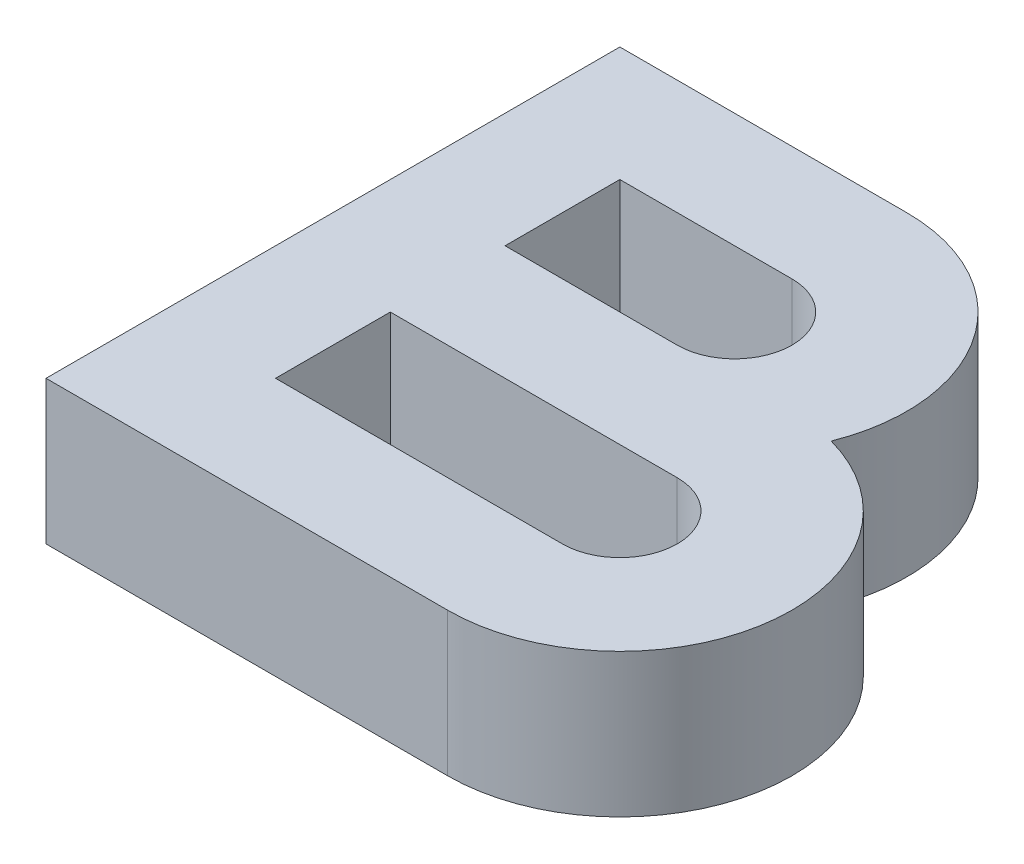
ISO-10303-21;
HEADER;
FILE_DESCRIPTION(('STEP AP214'),'2;1');
FILE_NAME('part.step','',(''),(''),'','','');
FILE_SCHEMA(('AUTOMOTIVE_DESIGN { 1 0 10303 214 1 1 1 1 }'));
ENDSEC;
DATA;
#1=APPLICATION_CONTEXT('core data for automotive mechanical design processes');
#2=APPLICATION_PROTOCOL_DEFINITION('international standard','automotive_design',2000,#1);
#3=PRODUCT_CONTEXT('',#1,'mechanical');
#4=PRODUCT('Part','Part','',(#3));
#5=PRODUCT_RELATED_PRODUCT_CATEGORY('part','',(#4));
#6=PRODUCT_DEFINITION_FORMATION('','',#4);
#7=PRODUCT_DEFINITION_CONTEXT('part definition',#1,'design');
#8=PRODUCT_DEFINITION('design','',#6,#7);
#9=PRODUCT_DEFINITION_SHAPE('','',#8);
#10=(LENGTH_UNIT() NAMED_UNIT(*) SI_UNIT(.MILLI.,.METRE.));
#11=(NAMED_UNIT(*) PLANE_ANGLE_UNIT() SI_UNIT($,.RADIAN.));
#12=(NAMED_UNIT(*) SI_UNIT($,.STERADIAN.) SOLID_ANGLE_UNIT());
#13=UNCERTAINTY_MEASURE_WITH_UNIT(LENGTH_MEASURE(1.E-05),#10,'distance_accuracy_value','');
#14=(GEOMETRIC_REPRESENTATION_CONTEXT(3) GLOBAL_UNCERTAINTY_ASSIGNED_CONTEXT((#13)) GLOBAL_UNIT_ASSIGNED_CONTEXT((#10,
#11,#12)) REPRESENTATION_CONTEXT('',''));
#15=CARTESIAN_POINT('',(0.,0.,0.));
#16=DIRECTION('',(0.,0.,1.));
#17=DIRECTION('',(1.,0.,0.));
#18=AXIS2_PLACEMENT_3D('',#15,#16,#17);
#19=CARTESIAN_POINT('',(78.,10.,-12.));
#20=DIRECTION('',(0.,1.,0.));
#21=DIRECTION('',(0.,0.,1.));
#22=AXIS2_PLACEMENT_3D('',#19,#20,#21);
#23=PLANE('',#22);
#24=DIRECTION('',(1.,0.,0.));
#25=VECTOR('',#24,1.);
#26=CARTESIAN_POINT('',(50.,10.,0.));
#27=LINE('',#26,#25);
#28=CARTESIAN_POINT('',(50.,10.,0.));
#29=VERTEX_POINT('',#28);
#30=CARTESIAN_POINT('',(78.,10.,0.));
#31=VERTEX_POINT('',#30);
#32=EDGE_CURVE('E195',#29,#31,#27,.T.);
#33=ORIENTED_EDGE('',*,*,#32,.T.);
#34=CARTESIAN_POINT('',(78.,10.,-12.));
#35=DIRECTION('',(0.,1.,0.));
#36=DIRECTION('',(0.,0.,1.));
#37=AXIS2_PLACEMENT_3D('',#34,#35,#36);
#38=CIRCLE('',#37,12.);
#39=CARTESIAN_POINT('',(81.1554175279993,10.,-23.5777087639997));
#40=VERTEX_POINT('',#39);
#41=EDGE_CURVE('E198',#31,#40,#38,.T.);
#42=ORIENTED_EDGE('',*,*,#41,.T.);
#43=CARTESIAN_POINT('',(70.,10.,-28.));
#44=DIRECTION('',(0.,1.,0.));
#45=DIRECTION('',(0.,0.,-1.));
#46=AXIS2_PLACEMENT_3D('',#43,#44,#45);
#47=CIRCLE('',#46,12.);
#48=CARTESIAN_POINT('',(70.,10.,-40.));
#49=VERTEX_POINT('',#48);
#50=EDGE_CURVE('E201',#40,#49,#47,.T.);
#51=ORIENTED_EDGE('',*,*,#50,.T.);
#52=DIRECTION('',(-1.,0.,0.));
#53=VECTOR('',#52,1.);
#54=CARTESIAN_POINT('',(50.,10.,-40.));
#55=LINE('',#54,#53);
#56=CARTESIAN_POINT('',(50.,10.,-40.));
#57=VERTEX_POINT('',#56);
#58=EDGE_CURVE('E203',#49,#57,#55,.T.);
#59=ORIENTED_EDGE('',*,*,#58,.T.);
#60=DIRECTION('',(0.,0.,1.));
#61=VECTOR('',#60,1.);
#62=CARTESIAN_POINT('',(50.,10.,0.));
#63=LINE('',#62,#61);
#64=EDGE_CURVE('E205',#57,#29,#63,.T.);
#65=ORIENTED_EDGE('',*,*,#64,.T.);
#66=EDGE_LOOP('',(#33,#42,#51,#59,#65));
#67=FACE_BOUND('',#66,.T.);
#68=DIRECTION('',(-1.,0.,0.));
#69=VECTOR('',#68,1.);
#70=CARTESIAN_POINT('',(58.,10.,-32.));
#71=LINE('',#70,#69);
#72=CARTESIAN_POINT('',(70.,10.,-32.));
#73=VERTEX_POINT('',#72);
#74=CARTESIAN_POINT('',(58.,10.,-32.));
#75=VERTEX_POINT('',#74);
#76=EDGE_CURVE('E166',#73,#75,#71,.T.);
#77=ORIENTED_EDGE('',*,*,#76,.F.);
#78=CARTESIAN_POINT('',(70.,10.,-28.));
#79=DIRECTION('',(0.,1.,0.));
#80=DIRECTION('',(0.,0.,1.));
#81=AXIS2_PLACEMENT_3D('',#78,#79,#80);
#82=CIRCLE('',#81,4.00000000000001);
#83=CARTESIAN_POINT('',(70.,10.,-24.));
#84=VERTEX_POINT('',#83);
#85=EDGE_CURVE('E164',#84,#73,#82,.T.);
#86=ORIENTED_EDGE('',*,*,#85,.F.);
#87=DIRECTION('',(1.,0.,0.));
#88=VECTOR('',#87,1.);
#89=CARTESIAN_POINT('',(58.,10.,-24.));
#90=LINE('',#89,#88);
#91=CARTESIAN_POINT('',(58.,10.,-24.));
#92=VERTEX_POINT('',#91);
#93=EDGE_CURVE('E172',#92,#84,#90,.T.);
#94=ORIENTED_EDGE('',*,*,#93,.F.);
#95=DIRECTION('',(0.,0.,1.));
#96=VECTOR('',#95,1.);
#97=CARTESIAN_POINT('',(58.,10.,-32.));
#98=LINE('',#97,#96);
#99=EDGE_CURVE('E169',#75,#92,#98,.T.);
#100=ORIENTED_EDGE('',*,*,#99,.F.);
#101=EDGE_LOOP('',(#77,#86,#94,#100));
#102=FACE_BOUND('',#101,.T.);
#103=DIRECTION('',(1.,0.,0.));
#104=VECTOR('',#103,1.);
#105=CARTESIAN_POINT('',(58.,10.,-8.));
#106=LINE('',#105,#104);
#107=CARTESIAN_POINT('',(58.,10.,-8.));
#108=VERTEX_POINT('',#107);
#109=CARTESIAN_POINT('',(78.,10.,-7.99999999999999));
#110=VERTEX_POINT('',#109);
#111=EDGE_CURVE('E136',#108,#110,#106,.T.);
#112=ORIENTED_EDGE('',*,*,#111,.F.);
#113=DIRECTION('',(0.,0.,1.));
#114=VECTOR('',#113,1.);
#115=CARTESIAN_POINT('',(58.,10.,-16.));
#116=LINE('',#115,#114);
#117=CARTESIAN_POINT('',(58.,10.,-16.));
#118=VERTEX_POINT('',#117);
#119=EDGE_CURVE('E128',#118,#108,#116,.T.);
#120=ORIENTED_EDGE('',*,*,#119,.F.);
#121=DIRECTION('',(-1.,0.,0.));
#122=VECTOR('',#121,1.);
#123=CARTESIAN_POINT('',(78.,10.,-16.));
#124=LINE('',#123,#122);
#125=CARTESIAN_POINT('',(78.,10.,-16.));
#126=VERTEX_POINT('',#125);
#127=EDGE_CURVE('E150',#126,#118,#124,.T.);
#128=ORIENTED_EDGE('',*,*,#127,.F.);
#129=CARTESIAN_POINT('',(78.,10.,-12.));
#130=DIRECTION('',(0.,1.,0.));
#131=DIRECTION('',(0.,0.,1.));
#132=AXIS2_PLACEMENT_3D('',#129,#130,#131);
#133=CIRCLE('',#132,3.99999999999999);
#134=EDGE_CURVE('E148',#110,#126,#133,.T.);
#135=ORIENTED_EDGE('',*,*,#134,.F.);
#136=EDGE_LOOP('',(#112,#120,#128,#135));
#137=FACE_BOUND('',#136,.T.);
#138=ADVANCED_FACE('F33',(#67,#102,#137),#23,.T.);
#139=CARTESIAN_POINT('',(78.,0.,-12.));
#140=DIRECTION('',(0.,1.,0.));
#141=DIRECTION('',(0.,0.,1.));
#142=AXIS2_PLACEMENT_3D('',#139,#140,#141);
#143=PLANE('',#142);
#144=CARTESIAN_POINT('',(70.,0.,-28.));
#145=DIRECTION('',(0.,1.,0.));
#146=DIRECTION('',(0.,0.,1.));
#147=AXIS2_PLACEMENT_3D('',#144,#145,#146);
#148=CIRCLE('',#147,4.00000000000001);
#149=CARTESIAN_POINT('',(70.,0.,-24.));
#150=VERTEX_POINT('',#149);
#151=CARTESIAN_POINT('',(70.,0.,-32.));
#152=VERTEX_POINT('',#151);
#153=EDGE_CURVE('E144',#150,#152,#148,.T.);
#154=ORIENTED_EDGE('',*,*,#153,.T.);
#155=DIRECTION('',(-1.,0.,0.));
#156=VECTOR('',#155,1.);
#157=CARTESIAN_POINT('',(58.,0.,-32.));
#158=LINE('',#157,#156);
#159=CARTESIAN_POINT('',(58.,0.,-32.));
#160=VERTEX_POINT('',#159);
#161=EDGE_CURVE('E177',#152,#160,#158,.T.);
#162=ORIENTED_EDGE('',*,*,#161,.T.);
#163=DIRECTION('',(0.,0.,1.));
#164=VECTOR('',#163,1.);
#165=CARTESIAN_POINT('',(58.,0.,-32.));
#166=LINE('',#165,#164);
#167=CARTESIAN_POINT('',(58.,0.,-24.));
#168=VERTEX_POINT('',#167);
#169=EDGE_CURVE('E180',#160,#168,#166,.T.);
#170=ORIENTED_EDGE('',*,*,#169,.T.);
#171=DIRECTION('',(1.,0.,0.));
#172=VECTOR('',#171,1.);
#173=CARTESIAN_POINT('',(58.,0.,-24.));
#174=LINE('',#173,#172);
#175=EDGE_CURVE('E167',#168,#150,#174,.T.);
#176=ORIENTED_EDGE('',*,*,#175,.T.);
#177=EDGE_LOOP('',(#154,#162,#170,#176));
#178=FACE_BOUND('',#177,.T.);
#179=DIRECTION('',(1.,0.,0.));
#180=VECTOR('',#179,1.);
#181=CARTESIAN_POINT('',(50.,0.,0.));
#182=LINE('',#181,#180);
#183=CARTESIAN_POINT('',(50.,0.,0.));
#184=VERTEX_POINT('',#183);
#185=CARTESIAN_POINT('',(78.,0.,0.));
#186=VERTEX_POINT('',#185);
#187=EDGE_CURVE('E194',#184,#186,#182,.T.);
#188=ORIENTED_EDGE('',*,*,#187,.F.);
#189=DIRECTION('',(0.,0.,1.));
#190=VECTOR('',#189,1.);
#191=CARTESIAN_POINT('',(50.,0.,0.));
#192=LINE('',#191,#190);
#193=CARTESIAN_POINT('',(50.,0.,-40.));
#194=VERTEX_POINT('',#193);
#195=EDGE_CURVE('E199',#194,#184,#192,.T.);
#196=ORIENTED_EDGE('',*,*,#195,.F.);
#197=DIRECTION('',(-1.,0.,0.));
#198=VECTOR('',#197,1.);
#199=CARTESIAN_POINT('',(50.,0.,-40.));
#200=LINE('',#199,#198);
#201=CARTESIAN_POINT('',(70.,0.,-40.));
#202=VERTEX_POINT('',#201);
#203=EDGE_CURVE('E214',#202,#194,#200,.T.);
#204=ORIENTED_EDGE('',*,*,#203,.F.);
#205=CARTESIAN_POINT('',(70.,0.,-28.));
#206=DIRECTION('',(0.,1.,0.));
#207=DIRECTION('',(0.,0.,-1.));
#208=AXIS2_PLACEMENT_3D('',#205,#206,#207);
#209=CIRCLE('',#208,12.);
#210=CARTESIAN_POINT('',(81.1554175279993,0.,-23.5777087639997));
#211=VERTEX_POINT('',#210);
#212=EDGE_CURVE('E212',#211,#202,#209,.T.);
#213=ORIENTED_EDGE('',*,*,#212,.F.);
#214=CARTESIAN_POINT('',(78.,0.,-12.));
#215=DIRECTION('',(0.,1.,0.));
#216=DIRECTION('',(0.,0.,1.));
#217=AXIS2_PLACEMENT_3D('',#214,#215,#216);
#218=CIRCLE('',#217,12.);
#219=EDGE_CURVE('E210',#186,#211,#218,.T.);
#220=ORIENTED_EDGE('',*,*,#219,.F.);
#221=EDGE_LOOP('',(#188,#196,#204,#213,#220));
#222=FACE_BOUND('',#221,.T.);
#223=DIRECTION('',(0.,0.,1.));
#224=VECTOR('',#223,1.);
#225=CARTESIAN_POINT('',(58.,0.,-16.));
#226=LINE('',#225,#224);
#227=CARTESIAN_POINT('',(58.,0.,-16.));
#228=VERTEX_POINT('',#227);
#229=CARTESIAN_POINT('',(58.,0.,-8.));
#230=VERTEX_POINT('',#229);
#231=EDGE_CURVE('E56',#228,#230,#226,.T.);
#232=ORIENTED_EDGE('',*,*,#231,.T.);
#233=DIRECTION('',(1.,0.,0.));
#234=VECTOR('',#233,1.);
#235=CARTESIAN_POINT('',(58.,0.,-8.));
#236=LINE('',#235,#234);
#237=CARTESIAN_POINT('',(78.,0.,-7.99999999999999));
#238=VERTEX_POINT('',#237);
#239=EDGE_CURVE('E143',#230,#238,#236,.T.);
#240=ORIENTED_EDGE('',*,*,#239,.T.);
#241=CARTESIAN_POINT('',(78.,0.,-12.));
#242=DIRECTION('',(0.,1.,0.));
#243=DIRECTION('',(0.,0.,1.));
#244=AXIS2_PLACEMENT_3D('',#241,#242,#243);
#245=CIRCLE('',#244,3.99999999999999);
#246=CARTESIAN_POINT('',(78.,0.,-16.));
#247=VERTEX_POINT('',#246);
#248=EDGE_CURVE('E156',#238,#247,#245,.T.);
#249=ORIENTED_EDGE('',*,*,#248,.T.);
#250=DIRECTION('',(-1.,0.,0.));
#251=VECTOR('',#250,1.);
#252=CARTESIAN_POINT('',(78.,0.,-16.));
#253=LINE('',#252,#251);
#254=EDGE_CURVE('E137',#247,#228,#253,.T.);
#255=ORIENTED_EDGE('',*,*,#254,.T.);
#256=EDGE_LOOP('',(#232,#240,#249,#255));
#257=FACE_BOUND('',#256,.T.);
#258=ADVANCED_FACE('F235',(#178,#222,#257),#143,.F.);
#259=CARTESIAN_POINT('',(50.,10.,0.));
#260=DIRECTION('',(0.,0.,-1.));
#261=DIRECTION('',(-1.,0.,0.));
#262=AXIS2_PLACEMENT_3D('',#259,#260,#261);
#263=PLANE('',#262);
#264=ORIENTED_EDGE('',*,*,#187,.T.);
#265=DIRECTION('',(0.,-1.,0.));
#266=VECTOR('',#265,1.);
#267=CARTESIAN_POINT('',(78.,10.,0.));
#268=LINE('',#267,#266);
#269=EDGE_CURVE('E11',#31,#186,#268,.T.);
#270=ORIENTED_EDGE('',*,*,#269,.F.);
#271=ORIENTED_EDGE('',*,*,#32,.F.);
#272=DIRECTION('',(0.,-1.,0.));
#273=VECTOR('',#272,1.);
#274=CARTESIAN_POINT('',(50.,10.,0.));
#275=LINE('',#274,#273);
#276=EDGE_CURVE('E207',#29,#184,#275,.T.);
#277=ORIENTED_EDGE('',*,*,#276,.T.);
#278=EDGE_LOOP('',(#264,#270,#271,#277));
#279=FACE_BOUND('',#278,.T.);
#280=ADVANCED_FACE('F35',(#279),#263,.F.);
#281=CARTESIAN_POINT('',(78.,10.,-12.));
#282=DIRECTION('',(0.,-1.,0.));
#283=DIRECTION('',(0.,0.,-1.));
#284=AXIS2_PLACEMENT_3D('',#281,#282,#283);
#285=CYLINDRICAL_SURFACE('',#284,12.);
#286=ORIENTED_EDGE('',*,*,#219,.T.);
#287=DIRECTION('',(0.,-1.,0.));
#288=VECTOR('',#287,1.);
#289=CARTESIAN_POINT('',(81.1554175279993,10.,-23.5777087639997));
#290=LINE('',#289,#288);
#291=EDGE_CURVE('E41',#40,#211,#290,.T.);
#292=ORIENTED_EDGE('',*,*,#291,.F.);
#293=ORIENTED_EDGE('',*,*,#41,.F.);
#294=ORIENTED_EDGE('',*,*,#269,.T.);
#295=EDGE_LOOP('',(#286,#292,#293,#294));
#296=FACE_BOUND('',#295,.T.);
#297=ADVANCED_FACE('F250',(#296),#285,.T.);
#298=CARTESIAN_POINT('',(70.,10.,-28.));
#299=DIRECTION('',(0.,-1.,0.));
#300=DIRECTION('',(0.,0.,-1.));
#301=AXIS2_PLACEMENT_3D('',#298,#299,#300);
#302=CYLINDRICAL_SURFACE('',#301,12.);
#303=ORIENTED_EDGE('',*,*,#212,.T.);
#304=DIRECTION('',(0.,-1.,0.));
#305=VECTOR('',#304,1.);
#306=CARTESIAN_POINT('',(70.,10.,-40.));
#307=LINE('',#306,#305);
#308=EDGE_CURVE('E222',#49,#202,#307,.T.);
#309=ORIENTED_EDGE('',*,*,#308,.F.);
#310=ORIENTED_EDGE('',*,*,#50,.F.);
#311=ORIENTED_EDGE('',*,*,#291,.T.);
#312=EDGE_LOOP('',(#303,#309,#310,#311));
#313=FACE_BOUND('',#312,.T.);
#314=ADVANCED_FACE('F229',(#313),#302,.T.);
#315=CARTESIAN_POINT('',(50.,10.,-40.));
#316=DIRECTION('',(0.,0.,1.));
#317=DIRECTION('',(1.,0.,0.));
#318=AXIS2_PLACEMENT_3D('',#315,#316,#317);
#319=PLANE('',#318);
#320=ORIENTED_EDGE('',*,*,#203,.T.);
#321=DIRECTION('',(0.,-1.,0.));
#322=VECTOR('',#321,1.);
#323=CARTESIAN_POINT('',(50.,10.,-40.));
#324=LINE('',#323,#322);
#325=EDGE_CURVE('E219',#57,#194,#324,.T.);
#326=ORIENTED_EDGE('',*,*,#325,.F.);
#327=ORIENTED_EDGE('',*,*,#58,.F.);
#328=ORIENTED_EDGE('',*,*,#308,.T.);
#329=EDGE_LOOP('',(#320,#326,#327,#328));
#330=FACE_BOUND('',#329,.T.);
#331=ADVANCED_FACE('F240',(#330),#319,.F.);
#332=CARTESIAN_POINT('',(50.,10.,0.));
#333=DIRECTION('',(1.,0.,0.));
#334=DIRECTION('',(0.,0.,-1.));
#335=AXIS2_PLACEMENT_3D('',#332,#333,#334);
#336=PLANE('',#335);
#337=ORIENTED_EDGE('',*,*,#195,.T.);
#338=ORIENTED_EDGE('',*,*,#276,.F.);
#339=ORIENTED_EDGE('',*,*,#64,.F.);
#340=ORIENTED_EDGE('',*,*,#325,.T.);
#341=EDGE_LOOP('',(#337,#338,#339,#340));
#342=FACE_BOUND('',#341,.T.);
#343=ADVANCED_FACE('F244',(#342),#336,.F.);
#344=CARTESIAN_POINT('',(70.,10.,-28.));
#345=DIRECTION('',(0.,-1.,0.));
#346=DIRECTION('',(0.,0.,-1.));
#347=AXIS2_PLACEMENT_3D('',#344,#345,#346);
#348=CYLINDRICAL_SURFACE('',#347,4.00000000000001);
#349=ORIENTED_EDGE('',*,*,#153,.F.);
#350=DIRECTION('',(0.,-1.,0.));
#351=VECTOR('',#350,1.);
#352=CARTESIAN_POINT('',(70.,10.,-24.));
#353=LINE('',#352,#351);
#354=EDGE_CURVE('E174',#84,#150,#353,.T.);
#355=ORIENTED_EDGE('',*,*,#354,.F.);
#356=ORIENTED_EDGE('',*,*,#85,.T.);
#357=DIRECTION('',(0.,-1.,0.));
#358=VECTOR('',#357,1.);
#359=CARTESIAN_POINT('',(70.,10.,-32.));
#360=LINE('',#359,#358);
#361=EDGE_CURVE('E191',#73,#152,#360,.T.);
#362=ORIENTED_EDGE('',*,*,#361,.T.);
#363=EDGE_LOOP('',(#349,#355,#356,#362));
#364=FACE_BOUND('',#363,.T.);
#365=ADVANCED_FACE('F264',(#364),#348,.F.);
#366=CARTESIAN_POINT('',(58.,10.,-32.));
#367=DIRECTION('',(0.,0.,1.));
#368=DIRECTION('',(1.,0.,0.));
#369=AXIS2_PLACEMENT_3D('',#366,#367,#368);
#370=PLANE('',#369);
#371=ORIENTED_EDGE('',*,*,#161,.F.);
#372=ORIENTED_EDGE('',*,*,#361,.F.);
#373=ORIENTED_EDGE('',*,*,#76,.T.);
#374=DIRECTION('',(0.,-1.,0.));
#375=VECTOR('',#374,1.);
#376=CARTESIAN_POINT('',(58.,10.,-32.));
#377=LINE('',#376,#375);
#378=EDGE_CURVE('E189',#75,#160,#377,.T.);
#379=ORIENTED_EDGE('',*,*,#378,.T.);
#380=EDGE_LOOP('',(#371,#372,#373,#379));
#381=FACE_BOUND('',#380,.T.);
#382=ADVANCED_FACE('F290',(#381),#370,.T.);
#383=CARTESIAN_POINT('',(58.,10.,-32.));
#384=DIRECTION('',(1.,0.,0.));
#385=DIRECTION('',(0.,0.,-1.));
#386=AXIS2_PLACEMENT_3D('',#383,#384,#385);
#387=PLANE('',#386);
#388=ORIENTED_EDGE('',*,*,#169,.F.);
#389=ORIENTED_EDGE('',*,*,#378,.F.);
#390=ORIENTED_EDGE('',*,*,#99,.T.);
#391=DIRECTION('',(0.,-1.,0.));
#392=VECTOR('',#391,1.);
#393=CARTESIAN_POINT('',(58.,10.,-24.));
#394=LINE('',#393,#392);
#395=EDGE_CURVE('E187',#92,#168,#394,.T.);
#396=ORIENTED_EDGE('',*,*,#395,.T.);
#397=EDGE_LOOP('',(#388,#389,#390,#396));
#398=FACE_BOUND('',#397,.T.);
#399=ADVANCED_FACE('F297',(#398),#387,.T.);
#400=CARTESIAN_POINT('',(58.,10.,-24.));
#401=DIRECTION('',(0.,0.,-1.));
#402=DIRECTION('',(-1.,0.,0.));
#403=AXIS2_PLACEMENT_3D('',#400,#401,#402);
#404=PLANE('',#403);
#405=ORIENTED_EDGE('',*,*,#175,.F.);
#406=ORIENTED_EDGE('',*,*,#395,.F.);
#407=ORIENTED_EDGE('',*,*,#93,.T.);
#408=ORIENTED_EDGE('',*,*,#354,.T.);
#409=EDGE_LOOP('',(#405,#406,#407,#408));
#410=FACE_BOUND('',#409,.T.);
#411=ADVANCED_FACE('F304',(#410),#404,.T.);
#412=CARTESIAN_POINT('',(58.,10.,-16.));
#413=DIRECTION('',(1.,0.,0.));
#414=DIRECTION('',(0.,0.,-1.));
#415=AXIS2_PLACEMENT_3D('',#412,#413,#414);
#416=PLANE('',#415);
#417=ORIENTED_EDGE('',*,*,#231,.F.);
#418=DIRECTION('',(0.,-1.,0.));
#419=VECTOR('',#418,1.);
#420=CARTESIAN_POINT('',(58.,10.,-16.));
#421=LINE('',#420,#419);
#422=EDGE_CURVE('E132',#118,#228,#421,.T.);
#423=ORIENTED_EDGE('',*,*,#422,.F.);
#424=ORIENTED_EDGE('',*,*,#119,.T.);
#425=DIRECTION('',(0.,-1.,0.));
#426=VECTOR('',#425,1.);
#427=CARTESIAN_POINT('',(58.,10.,-8.));
#428=LINE('',#427,#426);
#429=EDGE_CURVE('E131',#108,#230,#428,.T.);
#430=ORIENTED_EDGE('',*,*,#429,.T.);
#431=EDGE_LOOP('',(#417,#423,#424,#430));
#432=FACE_BOUND('',#431,.T.);
#433=ADVANCED_FACE('F130',(#432),#416,.T.);
#434=CARTESIAN_POINT('',(58.,10.,-8.));
#435=DIRECTION('',(0.,0.,-1.));
#436=DIRECTION('',(-1.,0.,0.));
#437=AXIS2_PLACEMENT_3D('',#434,#435,#436);
#438=PLANE('',#437);
#439=ORIENTED_EDGE('',*,*,#239,.F.);
#440=ORIENTED_EDGE('',*,*,#429,.F.);
#441=ORIENTED_EDGE('',*,*,#111,.T.);
#442=DIRECTION('',(0.,-1.,0.));
#443=VECTOR('',#442,1.);
#444=CARTESIAN_POINT('',(78.,10.,-7.99999999999999));
#445=LINE('',#444,#443);
#446=EDGE_CURVE('E145',#110,#238,#445,.T.);
#447=ORIENTED_EDGE('',*,*,#446,.T.);
#448=EDGE_LOOP('',(#439,#440,#441,#447));
#449=FACE_BOUND('',#448,.T.);
#450=ADVANCED_FACE('F140',(#449),#438,.T.);
#451=CARTESIAN_POINT('',(78.,10.,-12.));
#452=DIRECTION('',(0.,-1.,0.));
#453=DIRECTION('',(0.,0.,-1.));
#454=AXIS2_PLACEMENT_3D('',#451,#452,#453);
#455=CYLINDRICAL_SURFACE('',#454,3.99999999999999);
#456=ORIENTED_EDGE('',*,*,#248,.F.);
#457=ORIENTED_EDGE('',*,*,#446,.F.);
#458=ORIENTED_EDGE('',*,*,#134,.T.);
#459=DIRECTION('',(0.,-1.,0.));
#460=VECTOR('',#459,1.);
#461=CARTESIAN_POINT('',(78.,10.,-16.));
#462=LINE('',#461,#460);
#463=EDGE_CURVE('E48',#126,#247,#462,.T.);
#464=ORIENTED_EDGE('',*,*,#463,.T.);
#465=EDGE_LOOP('',(#456,#457,#458,#464));
#466=FACE_BOUND('',#465,.T.);
#467=ADVANCED_FACE('F325',(#466),#455,.F.);
#468=CARTESIAN_POINT('',(78.,10.,-16.));
#469=DIRECTION('',(0.,0.,1.));
#470=DIRECTION('',(1.,0.,0.));
#471=AXIS2_PLACEMENT_3D('',#468,#469,#470);
#472=PLANE('',#471);
#473=ORIENTED_EDGE('',*,*,#254,.F.);
#474=ORIENTED_EDGE('',*,*,#463,.F.);
#475=ORIENTED_EDGE('',*,*,#127,.T.);
#476=ORIENTED_EDGE('',*,*,#422,.T.);
#477=EDGE_LOOP('',(#473,#474,#475,#476));
#478=FACE_BOUND('',#477,.T.);
#479=ADVANCED_FACE('F332',(#478),#472,.T.);
#480=CLOSED_SHELL('',(#138,#258,#280,#297,#314,#331,#343,#365,#382,#399,#411,#433,#450,#467,#479));
#481=MANIFOLD_SOLID_BREP('B2',#480);
#482=ADVANCED_BREP_SHAPE_REPRESENTATION('',(#18,#481),#14);
#483=SHAPE_DEFINITION_REPRESENTATION(#9,#482);
ENDSEC;
END-ISO-10303-21;
